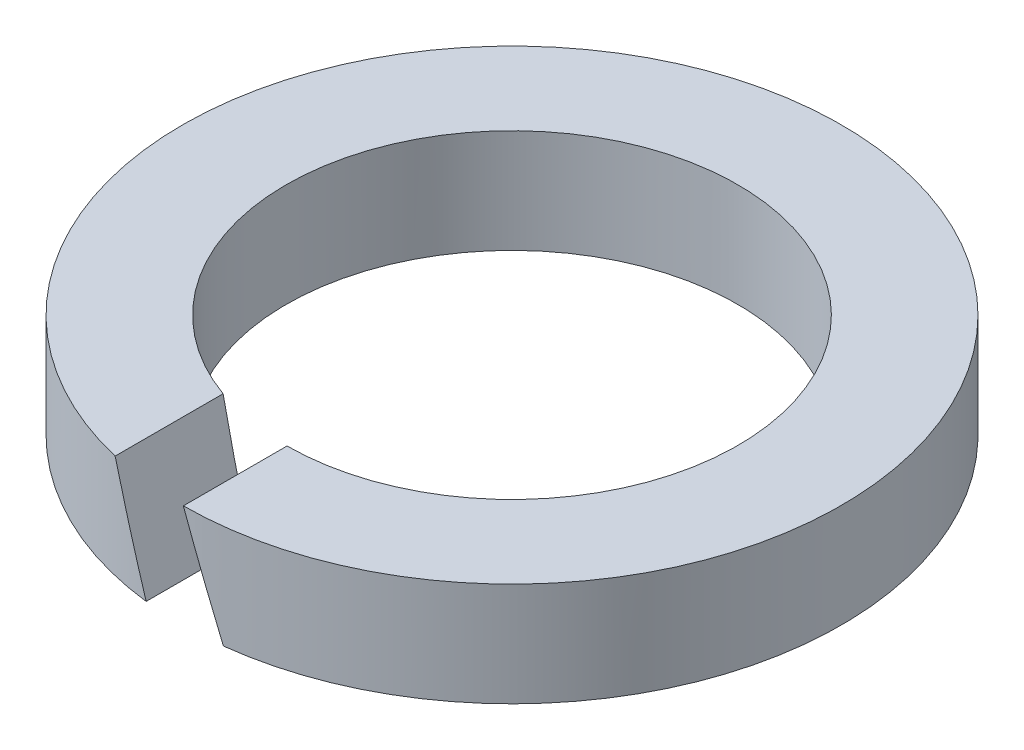
ISO-10303-21;
HEADER;
FILE_DESCRIPTION(('STEP AP214'),'2;1');
FILE_NAME('part.step','',(''),(''),'','','');
FILE_SCHEMA(('AUTOMOTIVE_DESIGN { 1 0 10303 214 1 1 1 1 }'));
ENDSEC;
DATA;
#1=APPLICATION_CONTEXT('core data for automotive mechanical design processes');
#2=APPLICATION_PROTOCOL_DEFINITION('international standard','automotive_design',2000,#1);
#3=PRODUCT_CONTEXT('',#1,'mechanical');
#4=PRODUCT('Part','Part','',(#3));
#5=PRODUCT_RELATED_PRODUCT_CATEGORY('part','',(#4));
#6=PRODUCT_DEFINITION_FORMATION('','',#4);
#7=PRODUCT_DEFINITION_CONTEXT('part definition',#1,'design');
#8=PRODUCT_DEFINITION('design','',#6,#7);
#9=PRODUCT_DEFINITION_SHAPE('','',#8);
#10=(LENGTH_UNIT() NAMED_UNIT(*) SI_UNIT(.MILLI.,.METRE.));
#11=(NAMED_UNIT(*) PLANE_ANGLE_UNIT() SI_UNIT($,.RADIAN.));
#12=(NAMED_UNIT(*) SI_UNIT($,.STERADIAN.) SOLID_ANGLE_UNIT());
#13=UNCERTAINTY_MEASURE_WITH_UNIT(LENGTH_MEASURE(1.E-05),#10,'distance_accuracy_value','');
#14=(GEOMETRIC_REPRESENTATION_CONTEXT(3) GLOBAL_UNCERTAINTY_ASSIGNED_CONTEXT((#13)) GLOBAL_UNIT_ASSIGNED_CONTEXT((#10,
#11,#12)) REPRESENTATION_CONTEXT('',''));
#15=CARTESIAN_POINT('',(0.,0.,0.));
#16=DIRECTION('',(0.,0.,1.));
#17=DIRECTION('',(1.,0.,0.));
#18=AXIS2_PLACEMENT_3D('',#15,#16,#17);
#19=CARTESIAN_POINT('',(0.,15.7596723055964,0.));
#20=DIRECTION('',(0.,1.,0.));
#21=DIRECTION('',(0.,0.,1.));
#22=AXIS2_PLACEMENT_3D('',#19,#20,#21);
#23=CYLINDRICAL_SURFACE('',#22,3.05);
#24=CARTESIAN_POINT('',(0.,0.,0.));
#25=DIRECTION('',(0.,1.,0.));
#26=DIRECTION('',(0.,0.,1.));
#27=AXIS2_PLACEMENT_3D('',#24,#25,#26);
#28=CIRCLE('',#27,3.05);
#29=CARTESIAN_POINT('',(0.521447108513197,0.,3.00509449319372));
#30=VERTEX_POINT('',#29);
#31=CARTESIAN_POINT('',(-0.521447108513196,0.,3.00509449319372));
#32=VERTEX_POINT('',#31);
#33=EDGE_CURVE('E96',#30,#32,#28,.T.);
#34=ORIENTED_EDGE('',*,*,#33,.F.);
#35=CARTESIAN_POINT('',(0.,1.43266415607993,0.));
#36=DIRECTION('',(-0.939692620785909,-0.342020143325666,0.));
#37=DIRECTION('',(-0.342020143325666,0.939692620785909,0.));
#38=AXIS2_PLACEMENT_3D('',#35,#36,#37);
#39=ELLIPSE('',#38,8.91760342049747,3.05);
#40=CARTESIAN_POINT('',(0.0118887805405174,1.4,3.04997682891153));
#41=VERTEX_POINT('',#40);
#42=EDGE_CURVE('E61',#41,#30,#39,.F.);
#43=ORIENTED_EDGE('',*,*,#42,.F.);
#44=CARTESIAN_POINT('',(0.,1.4,0.));
#45=DIRECTION('',(0.,1.,0.));
#46=DIRECTION('',(0.,0.,1.));
#47=AXIS2_PLACEMENT_3D('',#44,#45,#46);
#48=CIRCLE('',#47,3.05);
#49=CARTESIAN_POINT('',(-1.03100543648588,1.4,2.87045776661782));
#50=VERTEX_POINT('',#49);
#51=EDGE_CURVE('E11',#41,#50,#48,.T.);
#52=ORIENTED_EDGE('',*,*,#51,.T.);
#53=CARTESIAN_POINT('',(0.,-1.43266415607992,0.));
#54=DIRECTION('',(0.939692620785909,0.342020143325666,0.));
#55=DIRECTION('',(-0.342020143325666,0.939692620785909,0.));
#56=AXIS2_PLACEMENT_3D('',#53,#54,#55);
#57=ELLIPSE('',#56,8.91760342049748,3.05);
#58=EDGE_CURVE('E93',#32,#50,#57,.F.);
#59=ORIENTED_EDGE('',*,*,#58,.F.);
#60=EDGE_LOOP('',(#34,#43,#52,#59));
#61=FACE_BOUND('',#60,.T.);
#62=ADVANCED_FACE('F39',(#61),#23,.F.);
#63=CARTESIAN_POINT('',(-3.05,1.4,0.));
#64=DIRECTION('',(0.,1.,0.));
#65=DIRECTION('',(0.,0.,1.));
#66=AXIS2_PLACEMENT_3D('',#63,#64,#65);
#67=PLANE('',#66);
#68=ORIENTED_EDGE('',*,*,#51,.F.);
#69=DIRECTION('',(0.,0.,-1.));
#70=VECTOR('',#69,1.);
#71=CARTESIAN_POINT('',(0.0118887805405174,1.4,4.451));
#72=LINE('',#71,#70);
#73=CARTESIAN_POINT('',(0.0118887805405174,1.4,4.44998411872416));
#74=VERTEX_POINT('',#73);
#75=EDGE_CURVE('E98',#74,#41,#72,.T.);
#76=ORIENTED_EDGE('',*,*,#75,.F.);
#77=CARTESIAN_POINT('',(0.,1.4,0.));
#78=DIRECTION('',(0.,1.,0.));
#79=DIRECTION('',(0.,0.,1.));
#80=AXIS2_PLACEMENT_3D('',#77,#78,#79);
#81=CIRCLE('',#80,4.45);
#82=CARTESIAN_POINT('',(-1.03100543648588,1.4,4.32891762337153));
#83=VERTEX_POINT('',#82);
#84=EDGE_CURVE('E46',#74,#83,#81,.T.);
#85=ORIENTED_EDGE('',*,*,#84,.T.);
#86=DIRECTION('',(0.,0.,-1.));
#87=VECTOR('',#86,1.);
#88=CARTESIAN_POINT('',(-1.03100543648588,1.4,4.451));
#89=LINE('',#88,#87);
#90=EDGE_CURVE('E102',#83,#50,#89,.T.);
#91=ORIENTED_EDGE('',*,*,#90,.T.);
#92=EDGE_LOOP('',(#68,#76,#85,#91));
#93=FACE_BOUND('',#92,.T.);
#94=ADVANCED_FACE('F113',(#93),#67,.T.);
#95=CARTESIAN_POINT('',(0.,15.7596723055964,0.));
#96=DIRECTION('',(0.,1.,0.));
#97=DIRECTION('',(0.,0.,1.));
#98=AXIS2_PLACEMENT_3D('',#95,#96,#97);
#99=CYLINDRICAL_SURFACE('',#98,4.45);
#100=ORIENTED_EDGE('',*,*,#84,.F.);
#101=CARTESIAN_POINT('',(0.,1.43266415607993,0.));
#102=DIRECTION('',(-0.939692620785909,-0.342020143325666,0.));
#103=DIRECTION('',(-0.342020143325666,0.939692620785909,0.));
#104=AXIS2_PLACEMENT_3D('',#101,#102,#103);
#105=ELLIPSE('',#104,13.0109295807258,4.45);
#106=CARTESIAN_POINT('',(0.521447108513196,0.,4.41934304088551));
#107=VERTEX_POINT('',#106);
#108=EDGE_CURVE('E79',#107,#74,#105,.T.);
#109=ORIENTED_EDGE('',*,*,#108,.F.);
#110=CARTESIAN_POINT('',(0.,0.,0.));
#111=DIRECTION('',(0.,1.,0.));
#112=DIRECTION('',(0.,0.,1.));
#113=AXIS2_PLACEMENT_3D('',#110,#111,#112);
#114=CIRCLE('',#113,4.45);
#115=CARTESIAN_POINT('',(-0.521447108513196,0.,4.41934304088551));
#116=VERTEX_POINT('',#115);
#117=EDGE_CURVE('E91',#107,#116,#114,.T.);
#118=ORIENTED_EDGE('',*,*,#117,.T.);
#119=CARTESIAN_POINT('',(0.,-1.43266415607992,0.));
#120=DIRECTION('',(0.939692620785909,0.342020143325666,0.));
#121=DIRECTION('',(-0.342020143325666,0.939692620785909,0.));
#122=AXIS2_PLACEMENT_3D('',#119,#120,#121);
#123=ELLIPSE('',#122,13.0109295807258,4.45);
#124=EDGE_CURVE('E53',#83,#116,#123,.T.);
#125=ORIENTED_EDGE('',*,*,#124,.F.);
#126=EDGE_LOOP('',(#100,#109,#118,#125));
#127=FACE_BOUND('',#126,.T.);
#128=ADVANCED_FACE('F90',(#127),#99,.T.);
#129=CARTESIAN_POINT('',(-3.05,0.,0.));
#130=DIRECTION('',(0.,-1.,0.));
#131=DIRECTION('',(0.,0.,-1.));
#132=AXIS2_PLACEMENT_3D('',#129,#130,#131);
#133=PLANE('',#132);
#134=ORIENTED_EDGE('',*,*,#117,.F.);
#135=DIRECTION('',(0.,0.,-1.));
#136=VECTOR('',#135,1.);
#137=CARTESIAN_POINT('',(0.521447108513197,0.,4.451));
#138=LINE('',#137,#136);
#139=EDGE_CURVE('E76',#107,#30,#138,.T.);
#140=ORIENTED_EDGE('',*,*,#139,.T.);
#141=ORIENTED_EDGE('',*,*,#33,.T.);
#142=DIRECTION('',(0.,0.,-1.));
#143=VECTOR('',#142,1.);
#144=CARTESIAN_POINT('',(-0.521447108513197,0.,4.451));
#145=LINE('',#144,#143);
#146=EDGE_CURVE('E85',#116,#32,#145,.T.);
#147=ORIENTED_EDGE('',*,*,#146,.F.);
#148=EDGE_LOOP('',(#134,#140,#141,#147));
#149=FACE_BOUND('',#148,.T.);
#150=ADVANCED_FACE('F95',(#149),#133,.T.);
#151=CARTESIAN_POINT('',(-1.03100543648588,1.4,4.451));
#152=DIRECTION('',(0.939692620785909,0.342020143325666,0.));
#153=DIRECTION('',(-0.342020143325666,0.939692620785909,0.));
#154=AXIS2_PLACEMENT_3D('',#151,#152,#153);
#155=PLANE('',#154);
#156=ORIENTED_EDGE('',*,*,#58,.T.);
#157=ORIENTED_EDGE('',*,*,#90,.F.);
#158=ORIENTED_EDGE('',*,*,#124,.T.);
#159=ORIENTED_EDGE('',*,*,#146,.T.);
#160=EDGE_LOOP('',(#156,#157,#158,#159));
#161=FACE_BOUND('',#160,.T.);
#162=ADVANCED_FACE('F109',(#161),#155,.T.);
#163=CARTESIAN_POINT('',(0.0118887805405174,1.4,4.451));
#164=DIRECTION('',(-0.939692620785909,-0.342020143325666,0.));
#165=DIRECTION('',(0.342020143325666,-0.939692620785909,0.));
#166=AXIS2_PLACEMENT_3D('',#163,#164,#165);
#167=PLANE('',#166);
#168=ORIENTED_EDGE('',*,*,#42,.T.);
#169=ORIENTED_EDGE('',*,*,#139,.F.);
#170=ORIENTED_EDGE('',*,*,#108,.T.);
#171=ORIENTED_EDGE('',*,*,#75,.T.);
#172=EDGE_LOOP('',(#168,#169,#170,#171));
#173=FACE_BOUND('',#172,.T.);
#174=ADVANCED_FACE('F78',(#173),#167,.T.);
#175=CLOSED_SHELL('',(#62,#94,#128,#150,#162,#174));
#176=MANIFOLD_SOLID_BREP('B2',#175);
#177=ADVANCED_BREP_SHAPE_REPRESENTATION('',(#18,#176),#14);
#178=SHAPE_DEFINITION_REPRESENTATION(#9,#177);
ENDSEC;
END-ISO-10303-21;
